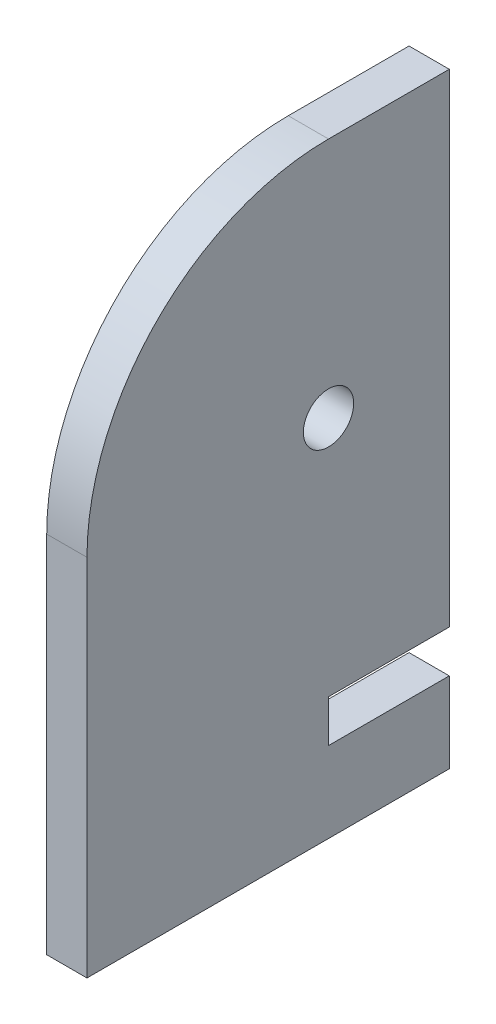
ISO-10303-21;
HEADER;
FILE_DESCRIPTION(('STEP AP214'),'2;1');
FILE_NAME('part.step','',(''),(''),'','','');
FILE_SCHEMA(('AUTOMOTIVE_DESIGN { 1 0 10303 214 1 1 1 1 }'));
ENDSEC;
DATA;
#1=APPLICATION_CONTEXT('core data for automotive mechanical design processes');
#2=APPLICATION_PROTOCOL_DEFINITION('international standard','automotive_design',2000,#1);
#3=PRODUCT_CONTEXT('',#1,'mechanical');
#4=PRODUCT('Part','Part','',(#3));
#5=PRODUCT_RELATED_PRODUCT_CATEGORY('part','',(#4));
#6=PRODUCT_DEFINITION_FORMATION('','',#4);
#7=PRODUCT_DEFINITION_CONTEXT('part definition',#1,'design');
#8=PRODUCT_DEFINITION('design','',#6,#7);
#9=PRODUCT_DEFINITION_SHAPE('','',#8);
#10=(LENGTH_UNIT() NAMED_UNIT(*) SI_UNIT(.MILLI.,.METRE.));
#11=(NAMED_UNIT(*) PLANE_ANGLE_UNIT() SI_UNIT($,.RADIAN.));
#12=(NAMED_UNIT(*) SI_UNIT($,.STERADIAN.) SOLID_ANGLE_UNIT());
#13=UNCERTAINTY_MEASURE_WITH_UNIT(LENGTH_MEASURE(1.E-05),#10,'distance_accuracy_value','');
#14=(GEOMETRIC_REPRESENTATION_CONTEXT(3) GLOBAL_UNCERTAINTY_ASSIGNED_CONTEXT((#13)) GLOBAL_UNIT_ASSIGNED_CONTEXT((#10,
#11,#12)) REPRESENTATION_CONTEXT('',''));
#15=CARTESIAN_POINT('',(0.,0.,0.));
#16=DIRECTION('',(0.,0.,1.));
#17=DIRECTION('',(1.,0.,0.));
#18=AXIS2_PLACEMENT_3D('',#15,#16,#17);
#19=CARTESIAN_POINT('',(6.35,0.,0.));
#20=DIRECTION('',(1.,0.,0.));
#21=DIRECTION('',(0.,0.,-1.));
#22=AXIS2_PLACEMENT_3D('',#19,#20,#21);
#23=PLANE('',#22);
#24=DIRECTION('',(0.,1.,0.));
#25=VECTOR('',#24,1.);
#26=CARTESIAN_POINT('',(6.35,-76.2,0.));
#27=LINE('',#26,#25);
#28=CARTESIAN_POINT('',(6.35,-89.535,0.));
#29=VERTEX_POINT('',#28);
#30=CARTESIAN_POINT('',(6.35,-76.2,0.));
#31=VERTEX_POINT('',#30);
#32=EDGE_CURVE('E153',#29,#31,#27,.T.);
#33=ORIENTED_EDGE('',*,*,#32,.T.);
#34=DIRECTION('',(0.,0.,-1.));
#35=VECTOR('',#34,1.);
#36=CARTESIAN_POINT('',(6.35,-76.2,0.));
#37=LINE('',#36,#35);
#38=CARTESIAN_POINT('',(6.35,-76.2,-38.1));
#39=VERTEX_POINT('',#38);
#40=EDGE_CURVE('E96',#31,#39,#37,.T.);
#41=ORIENTED_EDGE('',*,*,#40,.T.);
#42=DIRECTION('',(0.,1.,0.));
#43=VECTOR('',#42,1.);
#44=CARTESIAN_POINT('',(6.35,-76.2,-38.1));
#45=LINE('',#44,#43);
#46=CARTESIAN_POINT('',(6.35,76.2,-38.1));
#47=VERTEX_POINT('',#46);
#48=EDGE_CURVE('E171',#39,#47,#45,.T.);
#49=ORIENTED_EDGE('',*,*,#48,.T.);
#50=DIRECTION('',(0.,0.,1.));
#51=VECTOR('',#50,1.);
#52=CARTESIAN_POINT('',(6.35,76.2,-38.1));
#53=LINE('',#52,#51);
#54=CARTESIAN_POINT('',(6.35,76.2,0.));
#55=VERTEX_POINT('',#54);
#56=EDGE_CURVE('E188',#47,#55,#53,.T.);
#57=ORIENTED_EDGE('',*,*,#56,.T.);
#58=CARTESIAN_POINT('',(6.35,0.,0.));
#59=DIRECTION('',(1.,0.,0.));
#60=DIRECTION('',(0.,0.,-1.));
#61=AXIS2_PLACEMENT_3D('',#58,#59,#60);
#62=CIRCLE('',#61,76.2);
#63=CARTESIAN_POINT('',(6.35,0.,76.2));
#64=VERTEX_POINT('',#63);
#65=EDGE_CURVE('E187',#55,#64,#62,.T.);
#66=ORIENTED_EDGE('',*,*,#65,.T.);
#67=DIRECTION('',(0.,-1.,0.));
#68=VECTOR('',#67,1.);
#69=CARTESIAN_POINT('',(6.35,0.,76.2));
#70=LINE('',#69,#68);
#71=CARTESIAN_POINT('',(6.35,-114.935,76.2));
#72=VERTEX_POINT('',#71);
#73=EDGE_CURVE('E118',#64,#72,#70,.T.);
#74=ORIENTED_EDGE('',*,*,#73,.T.);
#75=DIRECTION('',(0.,0.,-1.));
#76=VECTOR('',#75,1.);
#77=CARTESIAN_POINT('',(6.35,-114.935,-38.1));
#78=LINE('',#77,#76);
#79=CARTESIAN_POINT('',(6.35,-114.935,-38.1));
#80=VERTEX_POINT('',#79);
#81=EDGE_CURVE('E112',#72,#80,#78,.T.);
#82=ORIENTED_EDGE('',*,*,#81,.T.);
#83=DIRECTION('',(0.,1.,0.));
#84=VECTOR('',#83,1.);
#85=CARTESIAN_POINT('',(6.35,-89.535,-38.1));
#86=LINE('',#85,#84);
#87=CARTESIAN_POINT('',(6.35,-89.535,-38.1));
#88=VERTEX_POINT('',#87);
#89=EDGE_CURVE('E116',#80,#88,#86,.T.);
#90=ORIENTED_EDGE('',*,*,#89,.T.);
#91=DIRECTION('',(0.,0.,1.));
#92=VECTOR('',#91,1.);
#93=CARTESIAN_POINT('',(6.35,-89.535,0.));
#94=LINE('',#93,#92);
#95=EDGE_CURVE('E50',#88,#29,#94,.T.);
#96=ORIENTED_EDGE('',*,*,#95,.T.);
#97=EDGE_LOOP('',(#33,#41,#49,#57,#66,#74,#82,#90,#96));
#98=FACE_BOUND('',#97,.T.);
#99=CARTESIAN_POINT('',(6.35,0.,0.));
#100=DIRECTION('',(1.,0.,0.));
#101=DIRECTION('',(0.,0.,-1.));
#102=AXIS2_PLACEMENT_3D('',#99,#100,#101);
#103=CIRCLE('',#102,7.9375);
#104=CARTESIAN_POINT('',(6.35,0.,-7.9375));
#105=VERTEX_POINT('',#104);
#106=EDGE_CURVE('E140',#105,#105,#103,.T.);
#107=ORIENTED_EDGE('',*,*,#106,.F.);
#108=EDGE_LOOP('',(#107));
#109=FACE_BOUND('',#108,.T.);
#110=ADVANCED_FACE('F33',(#98,#109),#23,.T.);
#111=CARTESIAN_POINT('',(-6.35,0.,0.));
#112=DIRECTION('',(1.,0.,0.));
#113=DIRECTION('',(0.,0.,-1.));
#114=AXIS2_PLACEMENT_3D('',#111,#112,#113);
#115=PLANE('',#114);
#116=DIRECTION('',(0.,1.,0.));
#117=VECTOR('',#116,1.);
#118=CARTESIAN_POINT('',(-6.35,-76.2,0.));
#119=LINE('',#118,#117);
#120=CARTESIAN_POINT('',(-6.35,-89.535,0.));
#121=VERTEX_POINT('',#120);
#122=CARTESIAN_POINT('',(-6.35,-76.2,0.));
#123=VERTEX_POINT('',#122);
#124=EDGE_CURVE('E136',#121,#123,#119,.T.);
#125=ORIENTED_EDGE('',*,*,#124,.F.);
#126=DIRECTION('',(0.,0.,1.));
#127=VECTOR('',#126,1.);
#128=CARTESIAN_POINT('',(-6.35,-89.535,0.));
#129=LINE('',#128,#127);
#130=CARTESIAN_POINT('',(-6.35,-89.535,-38.1));
#131=VERTEX_POINT('',#130);
#132=EDGE_CURVE('E88',#131,#121,#129,.T.);
#133=ORIENTED_EDGE('',*,*,#132,.F.);
#134=DIRECTION('',(0.,1.,0.));
#135=VECTOR('',#134,1.);
#136=CARTESIAN_POINT('',(-6.35,-89.535,-38.1));
#137=LINE('',#136,#135);
#138=CARTESIAN_POINT('',(-6.35,-114.935,-38.1));
#139=VERTEX_POINT('',#138);
#140=EDGE_CURVE('E82',#139,#131,#137,.T.);
#141=ORIENTED_EDGE('',*,*,#140,.F.);
#142=DIRECTION('',(0.,0.,-1.));
#143=VECTOR('',#142,1.);
#144=CARTESIAN_POINT('',(-6.35,-114.935,-38.1));
#145=LINE('',#144,#143);
#146=CARTESIAN_POINT('',(-6.35,-114.935,76.2));
#147=VERTEX_POINT('',#146);
#148=EDGE_CURVE('E126',#147,#139,#145,.T.);
#149=ORIENTED_EDGE('',*,*,#148,.F.);
#150=DIRECTION('',(0.,-1.,0.));
#151=VECTOR('',#150,1.);
#152=CARTESIAN_POINT('',(-6.35,0.,76.2));
#153=LINE('',#152,#151);
#154=CARTESIAN_POINT('',(-6.35,0.,76.2));
#155=VERTEX_POINT('',#154);
#156=EDGE_CURVE('E148',#155,#147,#153,.T.);
#157=ORIENTED_EDGE('',*,*,#156,.F.);
#158=CARTESIAN_POINT('',(-6.35,0.,0.));
#159=DIRECTION('',(1.,0.,0.));
#160=DIRECTION('',(0.,0.,-1.));
#161=AXIS2_PLACEMENT_3D('',#158,#159,#160);
#162=CIRCLE('',#161,76.2);
#163=CARTESIAN_POINT('',(-6.35,76.2,0.));
#164=VERTEX_POINT('',#163);
#165=EDGE_CURVE('E146',#164,#155,#162,.T.);
#166=ORIENTED_EDGE('',*,*,#165,.F.);
#167=DIRECTION('',(0.,0.,1.));
#168=VECTOR('',#167,1.);
#169=CARTESIAN_POINT('',(-6.35,76.2,-38.1));
#170=LINE('',#169,#168);
#171=CARTESIAN_POINT('',(-6.35,76.2,-38.1));
#172=VERTEX_POINT('',#171);
#173=EDGE_CURVE('E144',#172,#164,#170,.T.);
#174=ORIENTED_EDGE('',*,*,#173,.F.);
#175=DIRECTION('',(0.,1.,0.));
#176=VECTOR('',#175,1.);
#177=CARTESIAN_POINT('',(-6.35,-76.2,-38.1));
#178=LINE('',#177,#176);
#179=CARTESIAN_POINT('',(-6.35,-76.2,-38.1));
#180=VERTEX_POINT('',#179);
#181=EDGE_CURVE('E142',#180,#172,#178,.T.);
#182=ORIENTED_EDGE('',*,*,#181,.F.);
#183=DIRECTION('',(0.,0.,-1.));
#184=VECTOR('',#183,1.);
#185=CARTESIAN_POINT('',(-6.35,-76.2,0.));
#186=LINE('',#185,#184);
#187=EDGE_CURVE('E139',#123,#180,#186,.T.);
#188=ORIENTED_EDGE('',*,*,#187,.F.);
#189=EDGE_LOOP('',(#125,#133,#141,#149,#157,#166,#174,#182,#188));
#190=FACE_BOUND('',#189,.T.);
#191=CARTESIAN_POINT('',(-6.35,0.,0.));
#192=DIRECTION('',(1.,0.,0.));
#193=DIRECTION('',(0.,0.,-1.));
#194=AXIS2_PLACEMENT_3D('',#191,#192,#193);
#195=CIRCLE('',#194,7.9375);
#196=CARTESIAN_POINT('',(-6.35,0.,-7.9375));
#197=VERTEX_POINT('',#196);
#198=EDGE_CURVE('E195',#197,#197,#195,.T.);
#199=ORIENTED_EDGE('',*,*,#198,.T.);
#200=EDGE_LOOP('',(#199));
#201=FACE_BOUND('',#200,.T.);
#202=ADVANCED_FACE('F175',(#190,#201),#115,.F.);
#203=CARTESIAN_POINT('',(6.35,-76.2,0.));
#204=DIRECTION('',(0.,0.,1.));
#205=DIRECTION('',(0.,-1.,0.));
#206=AXIS2_PLACEMENT_3D('',#203,#204,#205);
#207=PLANE('',#206);
#208=ORIENTED_EDGE('',*,*,#124,.T.);
#209=DIRECTION('',(-1.,0.,0.));
#210=VECTOR('',#209,1.);
#211=CARTESIAN_POINT('',(6.35,-76.2,0.));
#212=LINE('',#211,#210);
#213=EDGE_CURVE('E11',#31,#123,#212,.T.);
#214=ORIENTED_EDGE('',*,*,#213,.F.);
#215=ORIENTED_EDGE('',*,*,#32,.F.);
#216=DIRECTION('',(-1.,0.,0.));
#217=VECTOR('',#216,1.);
#218=CARTESIAN_POINT('',(6.35,-89.535,0.));
#219=LINE('',#218,#217);
#220=EDGE_CURVE('E132',#29,#121,#219,.T.);
#221=ORIENTED_EDGE('',*,*,#220,.T.);
#222=EDGE_LOOP('',(#208,#214,#215,#221));
#223=FACE_BOUND('',#222,.T.);
#224=ADVANCED_FACE('F35',(#223),#207,.F.);
#225=CARTESIAN_POINT('',(6.35,-76.2,0.));
#226=DIRECTION('',(0.,1.,0.));
#227=DIRECTION('',(0.,0.,1.));
#228=AXIS2_PLACEMENT_3D('',#225,#226,#227);
#229=PLANE('',#228);
#230=ORIENTED_EDGE('',*,*,#187,.T.);
#231=DIRECTION('',(-1.,0.,0.));
#232=VECTOR('',#231,1.);
#233=CARTESIAN_POINT('',(6.35,-76.2,-38.1));
#234=LINE('',#233,#232);
#235=EDGE_CURVE('E42',#39,#180,#234,.T.);
#236=ORIENTED_EDGE('',*,*,#235,.F.);
#237=ORIENTED_EDGE('',*,*,#40,.F.);
#238=ORIENTED_EDGE('',*,*,#213,.T.);
#239=EDGE_LOOP('',(#230,#236,#237,#238));
#240=FACE_BOUND('',#239,.T.);
#241=ADVANCED_FACE('F227',(#240),#229,.F.);
#242=CARTESIAN_POINT('',(6.35,-76.2,-38.1));
#243=DIRECTION('',(0.,0.,1.));
#244=DIRECTION('',(1.,0.,0.));
#245=AXIS2_PLACEMENT_3D('',#242,#243,#244);
#246=PLANE('',#245);
#247=ORIENTED_EDGE('',*,*,#181,.T.);
#248=DIRECTION('',(-1.,0.,0.));
#249=VECTOR('',#248,1.);
#250=CARTESIAN_POINT('',(6.35,76.2,-38.1));
#251=LINE('',#250,#249);
#252=EDGE_CURVE('E163',#47,#172,#251,.T.);
#253=ORIENTED_EDGE('',*,*,#252,.F.);
#254=ORIENTED_EDGE('',*,*,#48,.F.);
#255=ORIENTED_EDGE('',*,*,#235,.T.);
#256=EDGE_LOOP('',(#247,#253,#254,#255));
#257=FACE_BOUND('',#256,.T.);
#258=ADVANCED_FACE('F169',(#257),#246,.F.);
#259=CARTESIAN_POINT('',(6.35,76.2,-38.1));
#260=DIRECTION('',(0.,-1.,0.));
#261=DIRECTION('',(0.,0.,-1.));
#262=AXIS2_PLACEMENT_3D('',#259,#260,#261);
#263=PLANE('',#262);
#264=ORIENTED_EDGE('',*,*,#173,.T.);
#265=DIRECTION('',(-1.,0.,0.));
#266=VECTOR('',#265,1.);
#267=CARTESIAN_POINT('',(6.35,76.2,0.));
#268=LINE('',#267,#266);
#269=EDGE_CURVE('E160',#55,#164,#268,.T.);
#270=ORIENTED_EDGE('',*,*,#269,.F.);
#271=ORIENTED_EDGE('',*,*,#56,.F.);
#272=ORIENTED_EDGE('',*,*,#252,.T.);
#273=EDGE_LOOP('',(#264,#270,#271,#272));
#274=FACE_BOUND('',#273,.T.);
#275=ADVANCED_FACE('F181',(#274),#263,.F.);
#276=CARTESIAN_POINT('',(6.35,0.,0.));
#277=DIRECTION('',(-1.,0.,0.));
#278=DIRECTION('',(0.,0.,1.));
#279=AXIS2_PLACEMENT_3D('',#276,#277,#278);
#280=CYLINDRICAL_SURFACE('',#279,76.2);
#281=ORIENTED_EDGE('',*,*,#165,.T.);
#282=DIRECTION('',(-1.,0.,0.));
#283=VECTOR('',#282,1.);
#284=CARTESIAN_POINT('',(6.35,0.,76.2));
#285=LINE('',#284,#283);
#286=EDGE_CURVE('E157',#64,#155,#285,.T.);
#287=ORIENTED_EDGE('',*,*,#286,.F.);
#288=ORIENTED_EDGE('',*,*,#65,.F.);
#289=ORIENTED_EDGE('',*,*,#269,.T.);
#290=EDGE_LOOP('',(#281,#287,#288,#289));
#291=FACE_BOUND('',#290,.T.);
#292=ADVANCED_FACE('F185',(#291),#280,.T.);
#293=CARTESIAN_POINT('',(6.35,0.,76.2));
#294=DIRECTION('',(0.,0.,-1.));
#295=DIRECTION('',(0.,1.,0.));
#296=AXIS2_PLACEMENT_3D('',#293,#294,#295);
#297=PLANE('',#296);
#298=ORIENTED_EDGE('',*,*,#156,.T.);
#299=DIRECTION('',(-1.,0.,0.));
#300=VECTOR('',#299,1.);
#301=CARTESIAN_POINT('',(6.35,-114.935,76.2));
#302=LINE('',#301,#300);
#303=EDGE_CURVE('E127',#72,#147,#302,.T.);
#304=ORIENTED_EDGE('',*,*,#303,.F.);
#305=ORIENTED_EDGE('',*,*,#73,.F.);
#306=ORIENTED_EDGE('',*,*,#286,.T.);
#307=EDGE_LOOP('',(#298,#304,#305,#306));
#308=FACE_BOUND('',#307,.T.);
#309=ADVANCED_FACE('F218',(#308),#297,.F.);
#310=CARTESIAN_POINT('',(6.35,-114.935,-38.1));
#311=DIRECTION('',(0.,1.,0.));
#312=DIRECTION('',(0.,0.,1.));
#313=AXIS2_PLACEMENT_3D('',#310,#311,#312);
#314=PLANE('',#313);
#315=ORIENTED_EDGE('',*,*,#148,.T.);
#316=DIRECTION('',(-1.,0.,0.));
#317=VECTOR('',#316,1.);
#318=CARTESIAN_POINT('',(6.35,-114.935,-38.1));
#319=LINE('',#318,#317);
#320=EDGE_CURVE('E123',#80,#139,#319,.T.);
#321=ORIENTED_EDGE('',*,*,#320,.F.);
#322=ORIENTED_EDGE('',*,*,#81,.F.);
#323=ORIENTED_EDGE('',*,*,#303,.T.);
#324=EDGE_LOOP('',(#315,#321,#322,#323));
#325=FACE_BOUND('',#324,.T.);
#326=ADVANCED_FACE('F124',(#325),#314,.F.);
#327=CARTESIAN_POINT('',(6.35,-89.535,-38.1));
#328=DIRECTION('',(0.,0.,1.));
#329=DIRECTION('',(1.,0.,0.));
#330=AXIS2_PLACEMENT_3D('',#327,#328,#329);
#331=PLANE('',#330);
#332=ORIENTED_EDGE('',*,*,#140,.T.);
#333=DIRECTION('',(-1.,0.,0.));
#334=VECTOR('',#333,1.);
#335=CARTESIAN_POINT('',(6.35,-89.535,-38.1));
#336=LINE('',#335,#334);
#337=EDGE_CURVE('E128',#88,#131,#336,.T.);
#338=ORIENTED_EDGE('',*,*,#337,.F.);
#339=ORIENTED_EDGE('',*,*,#89,.F.);
#340=ORIENTED_EDGE('',*,*,#320,.T.);
#341=EDGE_LOOP('',(#332,#338,#339,#340));
#342=FACE_BOUND('',#341,.T.);
#343=ADVANCED_FACE('F130',(#342),#331,.F.);
#344=CARTESIAN_POINT('',(6.35,-89.535,0.));
#345=DIRECTION('',(0.,-1.,0.));
#346=DIRECTION('',(0.,0.,-1.));
#347=AXIS2_PLACEMENT_3D('',#344,#345,#346);
#348=PLANE('',#347);
#349=ORIENTED_EDGE('',*,*,#132,.T.);
#350=ORIENTED_EDGE('',*,*,#220,.F.);
#351=ORIENTED_EDGE('',*,*,#95,.F.);
#352=ORIENTED_EDGE('',*,*,#337,.T.);
#353=EDGE_LOOP('',(#349,#350,#351,#352));
#354=FACE_BOUND('',#353,.T.);
#355=ADVANCED_FACE('F211',(#354),#348,.F.);
#356=CARTESIAN_POINT('',(6.35,0.,0.));
#357=DIRECTION('',(-1.,0.,0.));
#358=DIRECTION('',(0.,0.,1.));
#359=AXIS2_PLACEMENT_3D('',#356,#357,#358);
#360=CYLINDRICAL_SURFACE('',#359,7.9375);
#361=ORIENTED_EDGE('',*,*,#106,.T.);
#362=EDGE_LOOP('',(#361));
#363=FACE_BOUND('',#362,.T.);
#364=ORIENTED_EDGE('',*,*,#198,.F.);
#365=EDGE_LOOP('',(#364));
#366=FACE_BOUND('',#365,.T.);
#367=ADVANCED_FACE('F201',(#363,#366),#360,.F.);
#368=CLOSED_SHELL('',(#110,#202,#224,#241,#258,#275,#292,#309,#326,#343,#355,#367));
#369=MANIFOLD_SOLID_BREP('B2',#368);
#370=ADVANCED_BREP_SHAPE_REPRESENTATION('',(#18,#369),#14);
#371=SHAPE_DEFINITION_REPRESENTATION(#9,#370);
ENDSEC;
END-ISO-10303-21;
